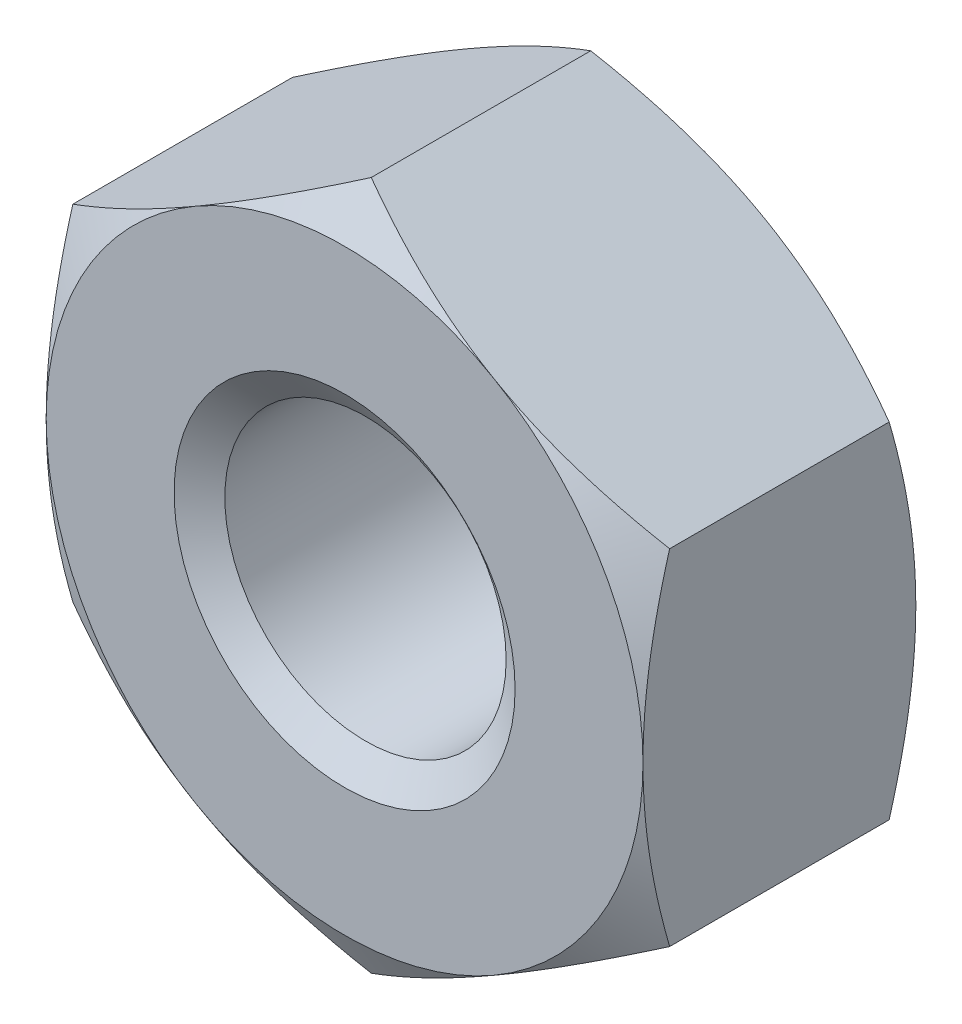
ISO-10303-21;
HEADER;
FILE_DESCRIPTION(('STEP AP214'),'2;1');
FILE_NAME('part.step','',(''),(''),'','','');
FILE_SCHEMA(('AUTOMOTIVE_DESIGN { 1 0 10303 214 1 1 1 1 }'));
ENDSEC;
DATA;
#1=APPLICATION_CONTEXT('core data for automotive mechanical design processes');
#2=APPLICATION_PROTOCOL_DEFINITION('international standard','automotive_design',2000,#1);
#3=PRODUCT_CONTEXT('',#1,'mechanical');
#4=PRODUCT('Part','Part','',(#3));
#5=PRODUCT_RELATED_PRODUCT_CATEGORY('part','',(#4));
#6=PRODUCT_DEFINITION_FORMATION('','',#4);
#7=PRODUCT_DEFINITION_CONTEXT('part definition',#1,'design');
#8=PRODUCT_DEFINITION('design','',#6,#7);
#9=PRODUCT_DEFINITION_SHAPE('','',#8);
#10=(LENGTH_UNIT() NAMED_UNIT(*) SI_UNIT(.MILLI.,.METRE.));
#11=(NAMED_UNIT(*) PLANE_ANGLE_UNIT() SI_UNIT($,.RADIAN.));
#12=(NAMED_UNIT(*) SI_UNIT($,.STERADIAN.) SOLID_ANGLE_UNIT());
#13=UNCERTAINTY_MEASURE_WITH_UNIT(LENGTH_MEASURE(1.E-05),#10,'distance_accuracy_value','');
#14=(GEOMETRIC_REPRESENTATION_CONTEXT(3) GLOBAL_UNCERTAINTY_ASSIGNED_CONTEXT((#13)) GLOBAL_UNIT_ASSIGNED_CONTEXT((#10,
#11,#12)) REPRESENTATION_CONTEXT('',''));
#15=CARTESIAN_POINT('',(0.,0.,0.));
#16=DIRECTION('',(0.,0.,1.));
#17=DIRECTION('',(1.,0.,0.));
#18=AXIS2_PLACEMENT_3D('',#15,#16,#17);
#19=CARTESIAN_POINT('',(0.,0.,-3.2));
#20=DIRECTION('',(0.,0.,1.));
#21=DIRECTION('',(1.,0.,0.));
#22=AXIS2_PLACEMENT_3D('',#19,#20,#21);
#23=CYLINDRICAL_SURFACE('',#22,1.65);
#24=CARTESIAN_POINT('',(0.,0.,-0.245072638373397));
#25=DIRECTION('',(0.,0.,1.));
#26=DIRECTION('',(1.,0.,0.));
#27=AXIS2_PLACEMENT_3D('',#24,#25,#26);
#28=CIRCLE('',#27,1.65);
#29=CARTESIAN_POINT('',(1.65,0.,-0.245072638373397));
#30=VERTEX_POINT('',#29);
#31=EDGE_CURVE('E174',#30,#30,#28,.F.);
#32=ORIENTED_EDGE('',*,*,#31,.F.);
#33=EDGE_LOOP('',(#32));
#34=FACE_BOUND('',#33,.T.);
#35=CARTESIAN_POINT('',(0.,0.,-2.9295273616266));
#36=DIRECTION('',(0.,0.,-1.));
#37=DIRECTION('',(-1.,0.,0.));
#38=AXIS2_PLACEMENT_3D('',#35,#36,#37);
#39=CIRCLE('',#38,1.65);
#40=CARTESIAN_POINT('',(-1.65,0.,-2.9295273616266));
#41=VERTEX_POINT('',#40);
#42=EDGE_CURVE('E39',#41,#41,#39,.F.);
#43=ORIENTED_EDGE('',*,*,#42,.F.);
#44=EDGE_LOOP('',(#43));
#45=FACE_BOUND('',#44,.T.);
#46=ADVANCED_FACE('F34',(#34,#45),#23,.F.);
#47=CARTESIAN_POINT('',(0.,4.04145188432739,-3.2));
#48=DIRECTION('',(0.,0.,-1.));
#49=DIRECTION('',(-1.,0.,0.));
#50=AXIS2_PLACEMENT_3D('',#47,#48,#49);
#51=PLANE('',#50);
#52=CARTESIAN_POINT('',(0.,0.,-3.2));
#53=DIRECTION('',(0.,0.,-1.));
#54=DIRECTION('',(-1.,0.,0.));
#55=AXIS2_PLACEMENT_3D('',#52,#53,#54);
#56=CIRCLE('',#55,3.5);
#57=CARTESIAN_POINT('',(-3.5,0.,-3.2));
#58=VERTEX_POINT('',#57);
#59=CARTESIAN_POINT('',(-1.75000000000002,-3.03108891324552,-3.2));
#60=VERTEX_POINT('',#59);
#61=EDGE_CURVE('E170',#58,#60,#56,.F.);
#62=ORIENTED_EDGE('',*,*,#61,.F.);
#63=CARTESIAN_POINT('',(-1.75000000000001,3.03108891324553,-3.2));
#64=VERTEX_POINT('',#63);
#65=EDGE_CURVE('E152',#64,#58,#56,.F.);
#66=ORIENTED_EDGE('',*,*,#65,.F.);
#67=CARTESIAN_POINT('',(1.75000000000002,3.03108891324552,-3.2));
#68=VERTEX_POINT('',#67);
#69=EDGE_CURVE('E169',#68,#64,#56,.F.);
#70=ORIENTED_EDGE('',*,*,#69,.F.);
#71=CARTESIAN_POINT('',(0.,0.,-3.2));
#72=DIRECTION('',(0.,0.,1.));
#73=DIRECTION('',(1.,0.,0.));
#74=AXIS2_PLACEMENT_3D('',#71,#72,#73);
#75=CIRCLE('',#74,3.5);
#76=CARTESIAN_POINT('',(3.5,0.,-3.2));
#77=VERTEX_POINT('',#76);
#78=EDGE_CURVE('E244',#77,#68,#75,.T.);
#79=ORIENTED_EDGE('',*,*,#78,.F.);
#80=CARTESIAN_POINT('',(1.75000000000001,-3.03108891324553,-3.2));
#81=VERTEX_POINT('',#80);
#82=EDGE_CURVE('E360',#81,#77,#56,.F.);
#83=ORIENTED_EDGE('',*,*,#82,.F.);
#84=EDGE_CURVE('E364',#60,#81,#56,.F.);
#85=ORIENTED_EDGE('',*,*,#84,.F.);
#86=EDGE_LOOP('',(#62,#66,#70,#79,#83,#85));
#87=FACE_BOUND('',#86,.T.);
#88=CARTESIAN_POINT('',(0.,0.,-3.2));
#89=DIRECTION('',(0.,0.,-1.));
#90=DIRECTION('',(-1.,0.,0.));
#91=AXIS2_PLACEMENT_3D('',#88,#89,#90);
#92=CIRCLE('',#91,2.);
#93=CARTESIAN_POINT('',(-2.,0.,-3.2));
#94=VERTEX_POINT('',#93);
#95=EDGE_CURVE('E177',#94,#94,#92,.F.);
#96=ORIENTED_EDGE('',*,*,#95,.T.);
#97=EDGE_LOOP('',(#96));
#98=FACE_BOUND('',#97,.T.);
#99=ADVANCED_FACE('F297',(#87,#98),#51,.T.);
#100=CARTESIAN_POINT('',(0.,4.04145188432739,0.));
#101=DIRECTION('',(0.,0.,-1.));
#102=DIRECTION('',(-1.,0.,0.));
#103=AXIS2_PLACEMENT_3D('',#100,#101,#102);
#104=PLANE('',#103);
#105=CARTESIAN_POINT('',(0.,0.,0.));
#106=DIRECTION('',(0.,0.,-1.));
#107=DIRECTION('',(-1.,0.,0.));
#108=AXIS2_PLACEMENT_3D('',#105,#106,#107);
#109=CIRCLE('',#108,3.5);
#110=CARTESIAN_POINT('',(-3.5,0.,0.));
#111=VERTEX_POINT('',#110);
#112=CARTESIAN_POINT('',(-1.75000000000001,3.03108891324553,0.));
#113=VERTEX_POINT('',#112);
#114=EDGE_CURVE('E11',#111,#113,#109,.T.);
#115=ORIENTED_EDGE('',*,*,#114,.F.);
#116=CARTESIAN_POINT('',(-1.75000000000002,-3.03108891324552,0.));
#117=VERTEX_POINT('',#116);
#118=EDGE_CURVE('E46',#117,#111,#109,.T.);
#119=ORIENTED_EDGE('',*,*,#118,.F.);
#120=CARTESIAN_POINT('',(1.75000000000001,-3.03108891324553,0.));
#121=VERTEX_POINT('',#120);
#122=EDGE_CURVE('E173',#121,#117,#109,.T.);
#123=ORIENTED_EDGE('',*,*,#122,.F.);
#124=CARTESIAN_POINT('',(3.5,0.,0.));
#125=VERTEX_POINT('',#124);
#126=EDGE_CURVE('E351',#125,#121,#109,.T.);
#127=ORIENTED_EDGE('',*,*,#126,.F.);
#128=CARTESIAN_POINT('',(0.,0.,0.));
#129=DIRECTION('',(0.,0.,1.));
#130=DIRECTION('',(1.,0.,0.));
#131=AXIS2_PLACEMENT_3D('',#128,#129,#130);
#132=CIRCLE('',#131,3.5);
#133=CARTESIAN_POINT('',(1.75000000000002,3.03108891324552,0.));
#134=VERTEX_POINT('',#133);
#135=EDGE_CURVE('E128',#125,#134,#132,.T.);
#136=ORIENTED_EDGE('',*,*,#135,.T.);
#137=EDGE_CURVE('E44',#113,#134,#109,.T.);
#138=ORIENTED_EDGE('',*,*,#137,.F.);
#139=EDGE_LOOP('',(#115,#119,#123,#127,#136,#138));
#140=FACE_BOUND('',#139,.T.);
#141=CARTESIAN_POINT('',(0.,0.,0.));
#142=DIRECTION('',(0.,0.,1.));
#143=DIRECTION('',(1.,0.,0.));
#144=AXIS2_PLACEMENT_3D('',#141,#142,#143);
#145=CIRCLE('',#144,2.);
#146=CARTESIAN_POINT('',(2.,0.,0.));
#147=VERTEX_POINT('',#146);
#148=EDGE_CURVE('E176',#147,#147,#145,.T.);
#149=ORIENTED_EDGE('',*,*,#148,.F.);
#150=EDGE_LOOP('',(#149));
#151=FACE_BOUND('',#150,.T.);
#152=ADVANCED_FACE('F249',(#140,#151),#104,.F.);
#153=CARTESIAN_POINT('',(0.,4.04145188432739,-3.2));
#154=DIRECTION('',(-0.500000000000003,0.866025403784437,0.));
#155=DIRECTION('',(-0.866025403784437,-0.500000000000003,0.));
#156=AXIS2_PLACEMENT_3D('',#153,#154,#155);
#157=PLANE('',#156);
#158=DIRECTION('',(0.,0.,1.));
#159=VECTOR('',#158,1.);
#160=CARTESIAN_POINT('',(-3.5,2.02072594216368,-3.2));
#161=LINE('',#160,#159);
#162=CARTESIAN_POINT('',(-3.5,2.02072594216372,-2.88739260883035));
#163=VERTEX_POINT('',#162);
#164=CARTESIAN_POINT('',(-3.5,2.02072594216368,-0.312607391169644));
#165=VERTEX_POINT('',#164);
#166=EDGE_CURVE('E164',#163,#165,#161,.T.);
#167=ORIENTED_EDGE('',*,*,#166,.T.);
#168=CARTESIAN_POINT('',(-3.5002,2.02061047210984,-0.312674060693372));
#169=CARTESIAN_POINT('',(-3.34639282154755,2.10941108799266,-0.261385788989984));
#170=CARTESIAN_POINT('',(-3.19125798916558,2.19897822522908,-0.214740953816197));
#171=CARTESIAN_POINT('',(-2.87830199342322,2.37966345361544,-0.133321875533348));
#172=CARTESIAN_POINT('',(-2.7204752692125,2.47078475532382,-0.0985764355845608));
#173=CARTESIAN_POINT('',(-2.40677778961987,2.65189807961073,-0.0444900271828351));
#174=CARTESIAN_POINT('',(-2.25095530083931,2.74186223545399,-0.0247890862603804));
#175=CARTESIAN_POINT('',(-1.93857711279463,2.92221386641055,-0.00127013273725341));
#176=CARTESIAN_POINT('',(-1.78202254896577,3.01260068598001,0.00256735545443538));
#177=CARTESIAN_POINT('',(-1.48949078007901,3.1814939814933,-0.00541530187697795));
#178=CARTESIAN_POINT('',(-1.35346978754209,3.26002573814993,-0.015275434069608));
#179=CARTESIAN_POINT('',(-1.082313979711,3.41657761679354,-0.046526466899406));
#180=CARTESIAN_POINT('',(-0.947180102315315,3.49459719728458,-0.0679280432858015));
#181=CARTESIAN_POINT('',(-0.675465207594812,3.65147186489429,-0.121430407880582));
#182=CARTESIAN_POINT('',(-0.538918580721659,3.73030709667644,-0.153757994445093));
#183=CARTESIAN_POINT('',(-0.267861907055491,3.88680174018325,-0.227128933808003));
#184=CARTESIAN_POINT('',(-0.133348387531455,3.9644631568901,-0.268155046569877));
#185=CARTESIAN_POINT('',(0.000200000000008864,4.04156735438123,-0.312674060693383));
#186=B_SPLINE_CURVE_WITH_KNOTS('',3,(#168,#169,#170,#171,#172,#173,#174,#175,#176,#177,#178,
#179,#180,#181,#182,#183,#184,#185),.UNSPECIFIED.,.F.,.F.,(4,2,2,2,2,2,2,2,4),(0.,
0.554793832886255,1.11092123814984,1.65328467083219,2.19498204478403,2.66665130850861,
3.13875761298268,3.62133612600511,4.10296698719189),.UNSPECIFIED.);
#187=EDGE_CURVE('E133',#165,#113,#186,.T.);
#188=ORIENTED_EDGE('',*,*,#187,.T.);
#189=CARTESIAN_POINT('',(0.,4.04145188432739,-0.312607391169655));
#190=VERTEX_POINT('',#189);
#191=EDGE_CURVE('E53',#113,#190,#186,.T.);
#192=ORIENTED_EDGE('',*,*,#191,.T.);
#193=DIRECTION('',(0.,0.,1.));
#194=VECTOR('',#193,1.);
#195=CARTESIAN_POINT('',(0.,4.04145188432739,-3.2));
#196=LINE('',#195,#194);
#197=CARTESIAN_POINT('',(0.,4.04145188432739,-2.88739260883035));
#198=VERTEX_POINT('',#197);
#199=EDGE_CURVE('E149',#198,#190,#196,.T.);
#200=ORIENTED_EDGE('',*,*,#199,.F.);
#201=CARTESIAN_POINT('',(-3.5002,2.02061047210984,-2.88732593930663));
#202=CARTESIAN_POINT('',(-3.34639282154755,2.10941108799266,-2.93861421101002));
#203=CARTESIAN_POINT('',(-3.19125798916558,2.19897822522908,-2.9852590461838));
#204=CARTESIAN_POINT('',(-2.87830199342322,2.37966345361544,-3.06667812446665));
#205=CARTESIAN_POINT('',(-2.7204752692125,2.47078475532382,-3.10142356441544));
#206=CARTESIAN_POINT('',(-2.40677778961987,2.65189807961073,-3.15550997281717));
#207=CARTESIAN_POINT('',(-2.25095530083931,2.74186223545399,-3.17521091373962));
#208=CARTESIAN_POINT('',(-1.93857711279463,2.92221386641055,-3.19872986726275));
#209=CARTESIAN_POINT('',(-1.78202254896577,3.01260068598001,-3.20256735545444));
#210=CARTESIAN_POINT('',(-1.48949078007901,3.1814939814933,-3.19458469812302));
#211=CARTESIAN_POINT('',(-1.35346978754209,3.26002573814993,-3.18472456593039));
#212=CARTESIAN_POINT('',(-1.082313979711,3.41657761679354,-3.1534735331006));
#213=CARTESIAN_POINT('',(-0.947180102315315,3.49459719728458,-3.1320719567142));
#214=CARTESIAN_POINT('',(-0.675465207594812,3.65147186489429,-3.07856959211942));
#215=CARTESIAN_POINT('',(-0.538918580721659,3.73030709667644,-3.04624200555491));
#216=CARTESIAN_POINT('',(-0.267861907055491,3.88680174018325,-2.972871066192));
#217=CARTESIAN_POINT('',(-0.133348387531456,3.9644631568901,-2.93184495343012));
#218=CARTESIAN_POINT('',(0.00020000000000887,4.04156735438123,-2.88732593930662));
#219=B_SPLINE_CURVE_WITH_KNOTS('',3,(#201,#202,#203,#204,#205,#206,#207,#208,#209,#210,#211,
#212,#213,#214,#215,#216,#217,#218),.UNSPECIFIED.,.F.,.F.,(4,2,2,2,2,2,2,2,4),(0.,
0.554793832886255,1.11092123814984,1.65328467083219,2.19498204478403,2.66665130850861,
3.13875761298268,3.62133612600511,4.10296698719189),.UNSPECIFIED.);
#220=EDGE_CURVE('E167',#64,#198,#219,.T.);
#221=ORIENTED_EDGE('',*,*,#220,.F.);
#222=EDGE_CURVE('E259',#163,#64,#219,.T.);
#223=ORIENTED_EDGE('',*,*,#222,.F.);
#224=EDGE_LOOP('',(#167,#188,#192,#200,#221,#223));
#225=FACE_BOUND('',#224,.T.);
#226=ADVANCED_FACE('F36',(#225),#157,.T.);
#227=CARTESIAN_POINT('',(3.5,2.02072594216367,-3.2));
#228=DIRECTION('',(0.500000000000007,0.866025403784435,0.));
#229=DIRECTION('',(-0.866025403784435,0.500000000000007,0.));
#230=AXIS2_PLACEMENT_3D('',#227,#228,#229);
#231=PLANE('',#230);
#232=ORIENTED_EDGE('',*,*,#199,.T.);
#233=CARTESIAN_POINT('',(-0.000199999999990868,4.04156735438123,-0.312674060693383));
#234=CARTESIAN_POINT('',(0.153607178452458,3.95276673849841,-0.261385788989994));
#235=CARTESIAN_POINT('',(0.308742010834433,3.86319960126199,-0.214740953816206));
#236=CARTESIAN_POINT('',(0.62169800657679,3.68251437287563,-0.133321875533356));
#237=CARTESIAN_POINT('',(0.779524730787505,3.59139307116725,-0.0985764355845671));
#238=CARTESIAN_POINT('',(1.09322221038014,3.41027974688034,-0.0444900271828396));
#239=CARTESIAN_POINT('',(1.2490446991607,3.32031559103708,-0.024789086260384));
#240=CARTESIAN_POINT('',(1.56142288720538,3.13996396008051,-0.00127013273725514));
#241=CARTESIAN_POINT('',(1.71797745103424,3.04957714051106,0.00256735545443454));
#242=CARTESIAN_POINT('',(2.010509219921,2.88068384499777,-0.00541530187697728));
#243=CARTESIAN_POINT('',(2.14653021245791,2.80215208834114,-0.0152754340696065));
#244=CARTESIAN_POINT('',(2.417686020289,2.64560020969752,-0.0465264668994026));
#245=CARTESIAN_POINT('',(2.55281989768469,2.56758062920648,-0.0679280432857971));
#246=CARTESIAN_POINT('',(2.82453479240519,2.41070596159677,-0.121430407880576));
#247=CARTESIAN_POINT('',(2.96108141927834,2.33187072981462,-0.153757994445086));
#248=CARTESIAN_POINT('',(3.23213809294451,2.17537608630781,-0.227128933807994));
#249=CARTESIAN_POINT('',(3.36665161246854,2.09771466960097,-0.268155046569867));
#250=CARTESIAN_POINT('',(3.5002,2.02061047210983,-0.312674060693371));
#251=B_SPLINE_CURVE_WITH_KNOTS('',3,(#233,#234,#235,#236,#237,#238,#239,#240,#241,#242,#243,
#244,#245,#246,#247,#248,#249,#250),.UNSPECIFIED.,.F.,.F.,(4,2,2,2,2,2,2,2,4),(0.,
0.554793832886257,1.11092123814984,1.6532846708322,2.19498204478404,2.66665130850861,
3.13875761298268,3.62133612600511,4.10296698719188),.UNSPECIFIED.);
#252=EDGE_CURVE('E143',#190,#134,#251,.T.);
#253=ORIENTED_EDGE('',*,*,#252,.T.);
#254=CARTESIAN_POINT('',(3.5,2.02072594216371,-0.312607391169655));
#255=VERTEX_POINT('',#254);
#256=EDGE_CURVE('E60',#134,#255,#251,.T.);
#257=ORIENTED_EDGE('',*,*,#256,.T.);
#258=DIRECTION('',(0.,0.,1.));
#259=VECTOR('',#258,1.);
#260=CARTESIAN_POINT('',(3.5,2.02072594216367,-3.2));
#261=LINE('',#260,#259);
#262=CARTESIAN_POINT('',(3.5,2.02072594216371,-2.88739260883035));
#263=VERTEX_POINT('',#262);
#264=EDGE_CURVE('E142',#263,#255,#261,.T.);
#265=ORIENTED_EDGE('',*,*,#264,.F.);
#266=CARTESIAN_POINT('',(-0.000199999999990853,4.04156735438123,-2.88732593930662));
#267=CARTESIAN_POINT('',(0.153607178452459,3.95276673849841,-2.93861421101001));
#268=CARTESIAN_POINT('',(0.308742010834433,3.86319960126199,-2.9852590461838));
#269=CARTESIAN_POINT('',(0.62169800657679,3.68251437287563,-3.06667812446665));
#270=CARTESIAN_POINT('',(0.779524730787505,3.59139307116725,-3.10142356441543));
#271=CARTESIAN_POINT('',(1.09322221038014,3.41027974688034,-3.15550997281716));
#272=CARTESIAN_POINT('',(1.2490446991607,3.32031559103708,-3.17521091373962));
#273=CARTESIAN_POINT('',(1.56142288720538,3.13996396008051,-3.19872986726275));
#274=CARTESIAN_POINT('',(1.71797745103424,3.04957714051106,-3.20256735545444));
#275=CARTESIAN_POINT('',(2.010509219921,2.88068384499777,-3.19458469812302));
#276=CARTESIAN_POINT('',(2.14653021245791,2.80215208834114,-3.1847245659304));
#277=CARTESIAN_POINT('',(2.417686020289,2.64560020969752,-3.1534735331006));
#278=CARTESIAN_POINT('',(2.55281989768469,2.56758062920648,-3.1320719567142));
#279=CARTESIAN_POINT('',(2.82453479240519,2.41070596159677,-3.07856959211943));
#280=CARTESIAN_POINT('',(2.96108141927834,2.33187072981462,-3.04624200555492));
#281=CARTESIAN_POINT('',(3.23213809294451,2.17537608630781,-2.97287106619201));
#282=CARTESIAN_POINT('',(3.36665161246854,2.09771466960097,-2.93184495343014));
#283=CARTESIAN_POINT('',(3.5002,2.02061047210983,-2.88732593930663));
#284=B_SPLINE_CURVE_WITH_KNOTS('',3,(#266,#267,#268,#269,#270,#271,#272,#273,#274,#275,#276,
#277,#278,#279,#280,#281,#282,#283),.UNSPECIFIED.,.F.,.F.,(4,2,2,2,2,2,2,2,4),(0.,
0.554793832886257,1.11092123814984,1.6532846708322,2.19498204478404,2.66665130850861,
3.13875761298268,3.62133612600511,4.10296698719188),.UNSPECIFIED.);
#285=EDGE_CURVE('E253',#68,#263,#284,.T.);
#286=ORIENTED_EDGE('',*,*,#285,.F.);
#287=EDGE_CURVE('E258',#198,#68,#284,.T.);
#288=ORIENTED_EDGE('',*,*,#287,.F.);
#289=EDGE_LOOP('',(#232,#253,#257,#265,#286,#288));
#290=FACE_BOUND('',#289,.T.);
#291=ADVANCED_FACE('F140',(#290),#231,.T.);
#292=CARTESIAN_POINT('',(3.5,2.02072594216367,-3.2));
#293=DIRECTION('',(-1.,0.,0.));
#294=DIRECTION('',(0.,0.,1.));
#295=AXIS2_PLACEMENT_3D('',#292,#293,#294);
#296=PLANE('',#295);
#297=CARTESIAN_POINT('',(3.5,-5.35926299121409,-1.6748434685856));
#298=CARTESIAN_POINT('',(3.5,-5.20559319908845,-1.60058173692107));
#299=CARTESIAN_POINT('',(3.5,-5.05156008083379,-1.52705822833151));
#300=CARTESIAN_POINT('',(3.5,-4.74257074180714,-1.38190950344755));
#301=CARTESIAN_POINT('',(3.5,-4.5876143668244,-1.31028461582136));
#302=CARTESIAN_POINT('',(3.5,-4.27574500225546,-1.16897765517627));
#303=CARTESIAN_POINT('',(3.5,-4.11882589028195,-1.09930904568019));
#304=CARTESIAN_POINT('',(3.5,-3.80369792903859,-0.962964262242787));
#305=CARTESIAN_POINT('',(3.5,-3.64548914750599,-0.896287932319544));
#306=CARTESIAN_POINT('',(3.5,-3.32556618401859,-0.765931819095091));
#307=CARTESIAN_POINT('',(3.5,-3.16383281219927,-0.702298873688887));
#308=CARTESIAN_POINT('',(3.5,-2.83845840945601,-0.580016702089512));
#309=CARTESIAN_POINT('',(3.5,-2.67481716858829,-0.52136803037071));
#310=CARTESIAN_POINT('',(3.5,-2.34570278472052,-0.410630279877038));
#311=CARTESIAN_POINT('',(3.5,-2.18023438248745,-0.358527255435872));
#312=CARTESIAN_POINT('',(3.5,-1.84694522806373,-0.262572936976455));
#313=CARTESIAN_POINT('',(3.5,-1.67912523787533,-0.218719033467169));
#314=CARTESIAN_POINT('',(3.5,-1.34101828610928,-0.141391945584796));
#315=CARTESIAN_POINT('',(3.5,-1.17073068027696,-0.107921525211981));
#316=CARTESIAN_POINT('',(3.5,-0.828102385138509,-0.0536149564320564));
#317=CARTESIAN_POINT('',(3.5,-0.655761694017326,-0.0327788191952413));
#318=CARTESIAN_POINT('',(3.5,-0.311020490924472,-0.00558408650575975));
#319=CARTESIAN_POINT('',(3.5,-0.138627397207281,0.000866163165908758));
#320=CARTESIAN_POINT('',(3.5,0.206038074906516,-0.0010535580779476));
#321=CARTESIAN_POINT('',(3.5,0.378310473023161,-0.00941968196343297));
#322=CARTESIAN_POINT('',(3.5,0.672490555822308,-0.0357688927868924));
#323=CARTESIAN_POINT('',(3.5,0.79472279108407,-0.0503206340384212));
#324=CARTESIAN_POINT('',(3.5,1.03824305430558,-0.0859367340533544));
#325=CARTESIAN_POINT('',(3.5,1.15953093025884,-0.107002119926139));
#326=CARTESIAN_POINT('',(3.5,1.52187914771345,-0.178863187081449));
#327=CARTESIAN_POINT('',(3.5,1.76124104212628,-0.238305275622005));
#328=CARTESIAN_POINT('',(3.5,2.11940971387704,-0.340826814402547));
#329=CARTESIAN_POINT('',(3.5,2.24008344316342,-0.377749699085175));
#330=CARTESIAN_POINT('',(3.5,2.48017139213724,-0.455249007699284));
#331=CARTESIAN_POINT('',(3.5,2.59958641795608,-0.495822911663539));
#332=CARTESIAN_POINT('',(3.5,2.83665760451793,-0.57977998678274));
#333=CARTESIAN_POINT('',(3.5,2.95431988203478,-0.623146060034302));
#334=CARTESIAN_POINT('',(3.5,3.18873153508794,-0.712423559566852));
#335=CARTESIAN_POINT('',(3.5,3.30548051959458,-0.758336014592935));
#336=CARTESIAN_POINT('',(3.5,3.42180736613342,-0.805270380724054));
#337=B_SPLINE_CURVE_WITH_KNOTS('',3,(#297,#298,#299,#300,#301,#302,#303,#304,#305,#306,#307,
#308,#309,#310,#311,#312,#313,#314,#315,#316,#317,#318,#319,#320,#321,#322,#323,#324,#325,#326,
#327,#328,#329,#330,#331,#332,#333,#334,#335,#336),.UNSPECIFIED.,.F.,.F.,(4,2,2,2,2,2,2,2,2,2,2,
2,2,2,2,2,2,2,2,4),(0.,0.512025318465739,1.02413870177436,1.53918270315242,2.05419982499224,
2.57553975872799,3.09693761309354,3.61720506610402,4.13730766217539,4.65754858684366,
5.17778997146964,5.69470725122285,6.21149033452403,6.58059623222333,6.94976036239486,
7.68863804939852,8.06719621660478,8.4454950747676,8.82166461280098,9.19798724733408),.UNSPECIFIED.);
#338=CARTESIAN_POINT('',(3.49999999999999,-2.02072594216373,-0.312607391169655));
#339=VERTEX_POINT('',#338);
#340=EDGE_CURVE('E135',#339,#125,#337,.T.);
#341=ORIENTED_EDGE('',*,*,#340,.F.);
#342=DIRECTION('',(0.,0.,1.));
#343=VECTOR('',#342,1.);
#344=CARTESIAN_POINT('',(3.5,-2.02072594216372,-3.2));
#345=LINE('',#344,#343);
#346=CARTESIAN_POINT('',(3.49999999999999,-2.02072594216373,-2.88739260883035));
#347=VERTEX_POINT('',#346);
#348=EDGE_CURVE('E150',#347,#339,#345,.T.);
#349=ORIENTED_EDGE('',*,*,#348,.F.);
#350=CARTESIAN_POINT('',(3.5,-5.35926299121409,-1.5251565314144));
#351=CARTESIAN_POINT('',(3.5,-5.20559319908845,-1.59941826307893));
#352=CARTESIAN_POINT('',(3.5,-5.05156008083379,-1.67294177166849));
#353=CARTESIAN_POINT('',(3.5,-4.74257074180714,-1.81809049655245));
#354=CARTESIAN_POINT('',(3.5,-4.5876143668244,-1.88971538417864));
#355=CARTESIAN_POINT('',(3.5,-4.27574500225546,-2.03102234482373));
#356=CARTESIAN_POINT('',(3.5,-4.11882589028195,-2.10069095431981));
#357=CARTESIAN_POINT('',(3.5,-3.80369792903859,-2.23703573775721));
#358=CARTESIAN_POINT('',(3.5,-3.64548914750599,-2.30371206768046));
#359=CARTESIAN_POINT('',(3.5,-3.32556618401859,-2.43406818090491));
#360=CARTESIAN_POINT('',(3.5,-3.16383281219927,-2.49770112631111));
#361=CARTESIAN_POINT('',(3.5,-2.838458409456,-2.61998329791049));
#362=CARTESIAN_POINT('',(3.5,-2.67481716858829,-2.67863196962929));
#363=CARTESIAN_POINT('',(3.5,-2.34570278472052,-2.78936972012296));
#364=CARTESIAN_POINT('',(3.5,-2.18023438248745,-2.84147274456413));
#365=CARTESIAN_POINT('',(3.5,-1.84694522806373,-2.93742706302355));
#366=CARTESIAN_POINT('',(3.5,-1.67912523787533,-2.98128096653283));
#367=CARTESIAN_POINT('',(3.5,-1.34101828610928,-3.05860805441521));
#368=CARTESIAN_POINT('',(3.5,-1.17073068027696,-3.09207847478802));
#369=CARTESIAN_POINT('',(3.5,-0.828102385138509,-3.14638504356795));
#370=CARTESIAN_POINT('',(3.5,-0.655761694017326,-3.16722118080476));
#371=CARTESIAN_POINT('',(3.5,-0.311020490924472,-3.19441591349424));
#372=CARTESIAN_POINT('',(3.5,-0.138627397207281,-3.20086616316591));
#373=CARTESIAN_POINT('',(3.5,0.206038074906516,-3.19894644192205));
#374=CARTESIAN_POINT('',(3.5,0.378310473023161,-3.19058031803657));
#375=CARTESIAN_POINT('',(3.5,0.672490555822308,-3.16423110721311));
#376=CARTESIAN_POINT('',(3.5,0.794722791084071,-3.14967936596158));
#377=CARTESIAN_POINT('',(3.5,1.03824305430558,-3.11406326594665));
#378=CARTESIAN_POINT('',(3.5,1.15953093025884,-3.09299788007386));
#379=CARTESIAN_POINT('',(3.5,1.52187914771345,-3.02113681291855));
#380=CARTESIAN_POINT('',(3.5,1.76124104212628,-2.961694724378));
#381=CARTESIAN_POINT('',(3.5,2.11940971387704,-2.85917318559745));
#382=CARTESIAN_POINT('',(3.5,2.24008344316342,-2.82225030091483));
#383=CARTESIAN_POINT('',(3.5,2.48017139213724,-2.74475099230072));
#384=CARTESIAN_POINT('',(3.5,2.59958641795608,-2.70417708833646));
#385=CARTESIAN_POINT('',(3.5,2.83665760451793,-2.62022001321726));
#386=CARTESIAN_POINT('',(3.5,2.95431988203478,-2.5768539399657));
#387=CARTESIAN_POINT('',(3.5,3.18873153508794,-2.48757644043315));
#388=CARTESIAN_POINT('',(3.5,3.30548051959458,-2.44166398540707));
#389=CARTESIAN_POINT('',(3.5,3.42180736613342,-2.39472961927595));
#390=B_SPLINE_CURVE_WITH_KNOTS('',3,(#350,#351,#352,#353,#354,#355,#356,#357,#358,#359,#360,
#361,#362,#363,#364,#365,#366,#367,#368,#369,#370,#371,#372,#373,#374,#375,#376,#377,#378,#379,
#380,#381,#382,#383,#384,#385,#386,#387,#388,#389),.UNSPECIFIED.,.F.,.F.,(4,2,2,2,2,2,2,2,2,2,2,
2,2,2,2,2,2,2,2,4),(0.,0.512025318465739,1.02413870177436,1.53918270315242,2.05419982499224,
2.57553975872799,3.09693761309354,3.61720506610402,4.13730766217539,4.65754858684366,
5.17778997146963,5.69470725122285,6.21149033452403,6.58059623222333,6.94976036239486,
7.68863804939852,8.06719621660478,8.4454950747676,8.82166461280097,9.19798724733408),.UNSPECIFIED.);
#391=EDGE_CURVE('E265',#347,#77,#390,.T.);
#392=ORIENTED_EDGE('',*,*,#391,.T.);
#393=EDGE_CURVE('E148',#77,#263,#390,.T.);
#394=ORIENTED_EDGE('',*,*,#393,.T.);
#395=ORIENTED_EDGE('',*,*,#264,.T.);
#396=EDGE_CURVE('E125',#125,#255,#337,.T.);
#397=ORIENTED_EDGE('',*,*,#396,.F.);
#398=EDGE_LOOP('',(#341,#349,#392,#394,#395,#397));
#399=FACE_BOUND('',#398,.T.);
#400=ADVANCED_FACE('F146',(#399),#296,.F.);
#401=CARTESIAN_POINT('',(0.,-4.04145188432744,-3.2));
#402=DIRECTION('',(0.500000000000004,-0.866025403784436,0.));
#403=DIRECTION('',(0.866025403784436,0.500000000000004,0.));
#404=AXIS2_PLACEMENT_3D('',#401,#402,#403);
#405=PLANE('',#404);
#406=ORIENTED_EDGE('',*,*,#348,.T.);
#407=CARTESIAN_POINT('',(3.5002,-2.02061047210988,-0.312674060693386));
#408=CARTESIAN_POINT('',(3.34639282154755,-2.1094110879927,-0.261385788989998));
#409=CARTESIAN_POINT('',(3.19125798916558,-2.19897822522913,-0.214740953816212));
#410=CARTESIAN_POINT('',(2.87830199342322,-2.37966345361549,-0.133321875533364));
#411=CARTESIAN_POINT('',(2.7204752692125,-2.47078475532386,-0.0985764355845775));
#412=CARTESIAN_POINT('',(2.40677778961987,-2.65189807961078,-0.0444900271828536));
#413=CARTESIAN_POINT('',(2.25095530083931,-2.74186223545403,-0.0247890862603999));
#414=CARTESIAN_POINT('',(1.93857711279462,-2.9222138664106,-0.00127013273727477));
#415=CARTESIAN_POINT('',(1.78202254896576,-3.01260068598006,0.00256735545441309));
#416=CARTESIAN_POINT('',(1.489490780079,-3.18149398149335,-0.00541530187700204));
#417=CARTESIAN_POINT('',(1.35346978754209,-3.26002573814998,-0.0152754340696328));
#418=CARTESIAN_POINT('',(1.082313979711,-3.41657761679359,-0.0465264668994314));
#419=CARTESIAN_POINT('',(0.947180102315313,-3.49459719728463,-0.0679280432858271));
#420=CARTESIAN_POINT('',(0.675465207594813,-3.65147186489434,-0.121430407880608));
#421=CARTESIAN_POINT('',(0.538918580721662,-3.73030709667649,-0.153757994445119));
#422=CARTESIAN_POINT('',(0.267861907055496,-3.8868017401833,-0.227128933808028));
#423=CARTESIAN_POINT('',(0.133348387531462,-3.96446315689014,-0.268155046569902));
#424=CARTESIAN_POINT('',(-0.000200000000001385,-4.04156735438127,-0.312674060693407));
#425=B_SPLINE_CURVE_WITH_KNOTS('',3,(#407,#408,#409,#410,#411,#412,#413,#414,#415,#416,#417,
#418,#419,#420,#421,#422,#423,#424),.UNSPECIFIED.,.F.,.F.,(4,2,2,2,2,2,2,2,4),(0.,
0.554793832886257,1.11092123814984,1.6532846708322,2.19498204478405,2.66665130850861,
3.13875761298269,3.62133612600511,4.10296698719189),.UNSPECIFIED.);
#426=EDGE_CURVE('E346',#339,#121,#425,.T.);
#427=ORIENTED_EDGE('',*,*,#426,.T.);
#428=CARTESIAN_POINT('',(0.,-4.04145188432739,-0.312607391169655));
#429=VERTEX_POINT('',#428);
#430=EDGE_CURVE('E225',#121,#429,#425,.T.);
#431=ORIENTED_EDGE('',*,*,#430,.T.);
#432=DIRECTION('',(0.,0.,1.));
#433=VECTOR('',#432,1.);
#434=CARTESIAN_POINT('',(0.,-4.04145188432744,-3.2));
#435=LINE('',#434,#433);
#436=CARTESIAN_POINT('',(0.,-4.04145188432739,-2.88739260883035));
#437=VERTEX_POINT('',#436);
#438=EDGE_CURVE('E155',#437,#429,#435,.T.);
#439=ORIENTED_EDGE('',*,*,#438,.F.);
#440=CARTESIAN_POINT('',(3.5002,-2.02061047210988,-2.88732593930662));
#441=CARTESIAN_POINT('',(3.34639282154755,-2.1094110879927,-2.93861421101));
#442=CARTESIAN_POINT('',(3.19125798916558,-2.19897822522913,-2.98525904618379));
#443=CARTESIAN_POINT('',(2.87830199342322,-2.37966345361549,-3.06667812446664));
#444=CARTESIAN_POINT('',(2.7204752692125,-2.47078475532386,-3.10142356441542));
#445=CARTESIAN_POINT('',(2.40677778961987,-2.65189807961078,-3.15550997281715));
#446=CARTESIAN_POINT('',(2.25095530083931,-2.74186223545403,-3.1752109137396));
#447=CARTESIAN_POINT('',(1.93857711279462,-2.9222138664106,-3.19872986726273));
#448=CARTESIAN_POINT('',(1.78202254896576,-3.01260068598006,-3.20256735545441));
#449=CARTESIAN_POINT('',(1.489490780079,-3.18149398149335,-3.194584698123));
#450=CARTESIAN_POINT('',(1.35346978754209,-3.26002573814998,-3.18472456593037));
#451=CARTESIAN_POINT('',(1.082313979711,-3.41657761679359,-3.15347353310057));
#452=CARTESIAN_POINT('',(0.947180102315312,-3.49459719728463,-3.13207195671417));
#453=CARTESIAN_POINT('',(0.675465207594813,-3.65147186489434,-3.07856959211939));
#454=CARTESIAN_POINT('',(0.538918580721661,-3.73030709667649,-3.04624200555488));
#455=CARTESIAN_POINT('',(0.267861907055496,-3.8868017401833,-2.97287106619197));
#456=CARTESIAN_POINT('',(0.133348387531462,-3.96446315689014,-2.9318449534301));
#457=CARTESIAN_POINT('',(-0.000200000000001391,-4.04156735438127,-2.88732593930659));
#458=B_SPLINE_CURVE_WITH_KNOTS('',3,(#440,#441,#442,#443,#444,#445,#446,#447,#448,#449,#450,
#451,#452,#453,#454,#455,#456,#457),.UNSPECIFIED.,.F.,.F.,(4,2,2,2,2,2,2,2,4),(0.,
0.554793832886258,1.11092123814984,1.6532846708322,2.19498204478405,2.66665130850862,
3.13875761298269,3.62133612600511,4.10296698719189),.UNSPECIFIED.);
#459=EDGE_CURVE('E271',#81,#437,#458,.T.);
#460=ORIENTED_EDGE('',*,*,#459,.F.);
#461=EDGE_CURVE('E270',#347,#81,#458,.T.);
#462=ORIENTED_EDGE('',*,*,#461,.F.);
#463=EDGE_LOOP('',(#406,#427,#431,#439,#460,#462));
#464=FACE_BOUND('',#463,.T.);
#465=ADVANCED_FACE('F281',(#464),#405,.T.);
#466=CARTESIAN_POINT('',(-3.5,-2.02072594216371,-3.2));
#467=DIRECTION('',(-0.500000000000006,-0.866025403784435,0.));
#468=DIRECTION('',(0.866025403784435,-0.500000000000006,0.));
#469=AXIS2_PLACEMENT_3D('',#466,#467,#468);
#470=PLANE('',#469);
#471=ORIENTED_EDGE('',*,*,#438,.T.);
#472=CARTESIAN_POINT('',(0.00019999999999873,-4.04156735438127,-0.312674060693407));
#473=CARTESIAN_POINT('',(-0.153607178452452,-3.95276673849845,-0.261385788990017));
#474=CARTESIAN_POINT('',(-0.308742010834428,-3.86319960126203,-0.214740953816229));
#475=CARTESIAN_POINT('',(-0.621698006576789,-3.68251437287567,-0.133321875533377));
#476=CARTESIAN_POINT('',(-0.779524730787505,-3.59139307116729,-0.0985764355845881));
#477=CARTESIAN_POINT('',(-1.09322221038014,-3.41027974688037,-0.0444900271828597));
#478=CARTESIAN_POINT('',(-1.24904469916071,-3.32031559103712,-0.0247890862604036));
#479=CARTESIAN_POINT('',(-1.56142288720539,-3.13996396008055,-0.00127013273727429));
#480=CARTESIAN_POINT('',(-1.71797745103425,-3.04957714051109,0.00256735545441543));
#481=CARTESIAN_POINT('',(-2.01050921992101,-2.8806838449978,-0.00541530187699616));
#482=CARTESIAN_POINT('',(-2.14653021245792,-2.80215208834117,-0.015275434069625));
#483=CARTESIAN_POINT('',(-2.41768602028901,-2.64560020969756,-0.0465264668994201));
#484=CARTESIAN_POINT('',(-2.55281989768469,-2.56758062920652,-0.067928043285814));
#485=CARTESIAN_POINT('',(-2.82453479240519,-2.41070596159681,-0.121430407880591));
#486=CARTESIAN_POINT('',(-2.96108141927834,-2.33187072981466,-0.1537579944451));
#487=CARTESIAN_POINT('',(-3.2321380929445,-2.17537608630785,-0.227128933808006));
#488=CARTESIAN_POINT('',(-3.36665161246854,-2.09771466960101,-0.268155046569878));
#489=CARTESIAN_POINT('',(-3.5002,-2.02061047210987,-0.312674060693381));
#490=B_SPLINE_CURVE_WITH_KNOTS('',3,(#472,#473,#474,#475,#476,#477,#478,#479,#480,#481,#482,
#483,#484,#485,#486,#487,#488,#489),.UNSPECIFIED.,.F.,.F.,(4,2,2,2,2,2,2,2,4),(0.,
0.554793832886263,1.11092123814985,1.65328467083221,2.19498204478406,2.66665130850863,
3.1387576129827,3.62133612600512,4.10296698719189),.UNSPECIFIED.);
#491=EDGE_CURVE('E344',#429,#117,#490,.T.);
#492=ORIENTED_EDGE('',*,*,#491,.T.);
#493=CARTESIAN_POINT('',(-3.5,-2.02072594216372,-0.312607391169655));
#494=VERTEX_POINT('',#493);
#495=EDGE_CURVE('E199',#117,#494,#490,.T.);
#496=ORIENTED_EDGE('',*,*,#495,.T.);
#497=DIRECTION('',(0.,0.,1.));
#498=VECTOR('',#497,1.);
#499=CARTESIAN_POINT('',(-3.5,-2.02072594216371,-3.2));
#500=LINE('',#499,#498);
#501=CARTESIAN_POINT('',(-3.5,-2.02072594216372,-2.88739260883035));
#502=VERTEX_POINT('',#501);
#503=EDGE_CURVE('E161',#502,#494,#500,.T.);
#504=ORIENTED_EDGE('',*,*,#503,.F.);
#505=CARTESIAN_POINT('',(0.000199999999998651,-4.04156735438127,-2.88732593930659));
#506=CARTESIAN_POINT('',(-0.153607178452452,-3.95276673849845,-2.93861421100998));
#507=CARTESIAN_POINT('',(-0.308742010834428,-3.86319960126203,-2.98525904618377));
#508=CARTESIAN_POINT('',(-0.621698006576789,-3.68251437287567,-3.06667812446662));
#509=CARTESIAN_POINT('',(-0.779524730787505,-3.59139307116729,-3.10142356441541));
#510=CARTESIAN_POINT('',(-1.09322221038014,-3.41027974688037,-3.15550997281714));
#511=CARTESIAN_POINT('',(-1.24904469916071,-3.32031559103712,-3.1752109137396));
#512=CARTESIAN_POINT('',(-1.56142288720539,-3.13996396008055,-3.19872986726273));
#513=CARTESIAN_POINT('',(-1.71797745103425,-3.04957714051109,-3.20256735545442));
#514=CARTESIAN_POINT('',(-2.01050921992101,-2.8806838449978,-3.19458469812301));
#515=CARTESIAN_POINT('',(-2.14653021245792,-2.80215208834117,-3.18472456593038));
#516=CARTESIAN_POINT('',(-2.41768602028901,-2.64560020969756,-3.15347353310058));
#517=CARTESIAN_POINT('',(-2.55281989768469,-2.56758062920652,-3.13207195671419));
#518=CARTESIAN_POINT('',(-2.82453479240519,-2.41070596159681,-3.07856959211941));
#519=CARTESIAN_POINT('',(-2.96108141927834,-2.33187072981466,-3.0462420055549));
#520=CARTESIAN_POINT('',(-3.2321380929445,-2.17537608630785,-2.972871066192));
#521=CARTESIAN_POINT('',(-3.36665161246854,-2.09771466960101,-2.93184495343012));
#522=CARTESIAN_POINT('',(-3.5002,-2.02061047210988,-2.88732593930662));
#523=B_SPLINE_CURVE_WITH_KNOTS('',3,(#505,#506,#507,#508,#509,#510,#511,#512,#513,#514,#515,
#516,#517,#518,#519,#520,#521,#522),.UNSPECIFIED.,.F.,.F.,(4,2,2,2,2,2,2,2,4),(0.,
0.554793832886262,1.11092123814985,1.65328467083221,2.19498204478406,2.66665130850863,
3.1387576129827,3.62133612600512,4.10296698719189),.UNSPECIFIED.);
#524=EDGE_CURVE('E277',#60,#502,#523,.T.);
#525=ORIENTED_EDGE('',*,*,#524,.F.);
#526=EDGE_CURVE('E276',#437,#60,#523,.T.);
#527=ORIENTED_EDGE('',*,*,#526,.F.);
#528=EDGE_LOOP('',(#471,#492,#496,#504,#525,#527));
#529=FACE_BOUND('',#528,.T.);
#530=ADVANCED_FACE('F284',(#529),#470,.T.);
#531=CARTESIAN_POINT('',(-3.5,2.02072594216368,-3.2));
#532=DIRECTION('',(-1.,0.,0.));
#533=DIRECTION('',(0.,0.,1.));
#534=AXIS2_PLACEMENT_3D('',#531,#532,#533);
#535=PLANE('',#534);
#536=ORIENTED_EDGE('',*,*,#503,.T.);
#537=CARTESIAN_POINT('',(-3.5,-5.35926299121408,-1.67484346858559));
#538=CARTESIAN_POINT('',(-3.5,-5.20559319908844,-1.60058173692106));
#539=CARTESIAN_POINT('',(-3.5,-5.05156008083377,-1.5270582283315));
#540=CARTESIAN_POINT('',(-3.5,-4.74257074180712,-1.38190950344754));
#541=CARTESIAN_POINT('',(-3.5,-4.58761436682439,-1.31028461582135));
#542=CARTESIAN_POINT('',(-3.5,-4.27574500225544,-1.16897765517626));
#543=CARTESIAN_POINT('',(-3.5,-4.11882589028194,-1.09930904568018));
#544=CARTESIAN_POINT('',(-3.5,-3.80369792903857,-0.96296426224278));
#545=CARTESIAN_POINT('',(-3.5,-3.64548914750597,-0.896287932319536));
#546=CARTESIAN_POINT('',(-3.5,-3.32556618401857,-0.765931819095083));
#547=CARTESIAN_POINT('',(-3.5,-3.16383281219926,-0.702298873688881));
#548=CARTESIAN_POINT('',(-3.5,-2.83845840945599,-0.580016702089506));
#549=CARTESIAN_POINT('',(-3.5,-2.67481716858828,-0.521368030370704));
#550=CARTESIAN_POINT('',(-3.5,-2.34570278472051,-0.410630279877032));
#551=CARTESIAN_POINT('',(-3.5,-2.18023438248744,-0.358527255435867));
#552=CARTESIAN_POINT('',(-3.5,-1.84694522806371,-0.262572936976451));
#553=CARTESIAN_POINT('',(-3.5,-1.67912523787532,-0.218719033467165));
#554=CARTESIAN_POINT('',(-3.5,-1.34101828610927,-0.141391945584792));
#555=CARTESIAN_POINT('',(-3.5,-1.17073068027695,-0.107921525211977));
#556=CARTESIAN_POINT('',(-3.5,-0.828102385138499,-0.053614956432053));
#557=CARTESIAN_POINT('',(-3.5,-0.655761694017317,-0.0327788191952385));
#558=CARTESIAN_POINT('',(-3.5,-0.311020490924463,-0.00558408650575752));
#559=CARTESIAN_POINT('',(-3.5,-0.138627397207273,0.000866163165910959));
#560=CARTESIAN_POINT('',(-3.5,0.206038074906523,-0.0010535580779458));
#561=CARTESIAN_POINT('',(-3.5,0.378310473023168,-0.00941968196343152));
#562=CARTESIAN_POINT('',(-3.5,0.672490555822314,-0.0357688927868914));
#563=CARTESIAN_POINT('',(-3.5,0.794722791084077,-0.0503206340384203));
#564=CARTESIAN_POINT('',(-3.5,1.03824305430558,-0.0859367340533538));
#565=CARTESIAN_POINT('',(-3.5,1.15953093025885,-0.107002119926138));
#566=CARTESIAN_POINT('',(-3.5,1.52187914771346,-0.178863187081449));
#567=CARTESIAN_POINT('',(-3.5,1.76124104212629,-0.238305275622005));
#568=CARTESIAN_POINT('',(-3.5,2.11940971387705,-0.340826814402547));
#569=CARTESIAN_POINT('',(-3.5,2.24008344316343,-0.377749699085175));
#570=CARTESIAN_POINT('',(-3.5,2.48017139213724,-0.455249007699284));
#571=CARTESIAN_POINT('',(-3.5,2.59958641795609,-0.49582291166354));
#572=CARTESIAN_POINT('',(-3.5,2.83665760451794,-0.579779986782741));
#573=CARTESIAN_POINT('',(-3.5,2.95431988203479,-0.623146060034303));
#574=CARTESIAN_POINT('',(-3.5,3.18873153508795,-0.712423559566854));
#575=CARTESIAN_POINT('',(-3.5,3.30548051959459,-0.758336014592937));
#576=CARTESIAN_POINT('',(-3.5,3.42180736613343,-0.805270380724056));
#577=B_SPLINE_CURVE_WITH_KNOTS('',3,(#537,#538,#539,#540,#541,#542,#543,#544,#545,#546,#547,
#548,#549,#550,#551,#552,#553,#554,#555,#556,#557,#558,#559,#560,#561,#562,#563,#564,#565,#566,
#567,#568,#569,#570,#571,#572,#573,#574,#575,#576),.UNSPECIFIED.,.F.,.F.,(4,2,2,2,2,2,2,2,2,2,2,
2,2,2,2,2,2,2,2,4),(0.,0.512025318465738,1.02413870177436,1.53918270315241,2.05419982499224,
2.57553975872799,3.09693761309354,3.61720506610401,4.13730766217538,4.65754858684366,
5.17778997146963,5.69470725122284,6.21149033452402,6.58059623222332,6.94976036239485,
7.6886380493985,8.06719621660477,8.44549507476759,8.82166461280097,9.19798724733407),.UNSPECIFIED.);
#578=EDGE_CURVE('E198',#494,#111,#577,.T.);
#579=ORIENTED_EDGE('',*,*,#578,.T.);
#580=EDGE_CURVE('E191',#111,#165,#577,.T.);
#581=ORIENTED_EDGE('',*,*,#580,.T.);
#582=ORIENTED_EDGE('',*,*,#166,.F.);
#583=CARTESIAN_POINT('',(-3.5,-5.35926299121408,-1.52515653141441));
#584=CARTESIAN_POINT('',(-3.5,-5.20559319908844,-1.59941826307894));
#585=CARTESIAN_POINT('',(-3.5,-5.05156008083377,-1.6729417716685));
#586=CARTESIAN_POINT('',(-3.5,-4.74257074180712,-1.81809049655246));
#587=CARTESIAN_POINT('',(-3.5,-4.58761436682439,-1.88971538417865));
#588=CARTESIAN_POINT('',(-3.5,-4.27574500225544,-2.03102234482374));
#589=CARTESIAN_POINT('',(-3.5,-4.11882589028194,-2.10069095431982));
#590=CARTESIAN_POINT('',(-3.5,-3.80369792903857,-2.23703573775722));
#591=CARTESIAN_POINT('',(-3.5,-3.64548914750597,-2.30371206768047));
#592=CARTESIAN_POINT('',(-3.5,-3.32556618401857,-2.43406818090492));
#593=CARTESIAN_POINT('',(-3.5,-3.16383281219926,-2.49770112631112));
#594=CARTESIAN_POINT('',(-3.5,-2.83845840945599,-2.6199832979105));
#595=CARTESIAN_POINT('',(-3.5,-2.67481716858828,-2.6786319696293));
#596=CARTESIAN_POINT('',(-3.5,-2.34570278472051,-2.78936972012297));
#597=CARTESIAN_POINT('',(-3.5,-2.18023438248744,-2.84147274456413));
#598=CARTESIAN_POINT('',(-3.5,-1.84694522806371,-2.93742706302355));
#599=CARTESIAN_POINT('',(-3.5,-1.67912523787532,-2.98128096653284));
#600=CARTESIAN_POINT('',(-3.5,-1.34101828610927,-3.05860805441521));
#601=CARTESIAN_POINT('',(-3.5,-1.17073068027695,-3.09207847478803));
#602=CARTESIAN_POINT('',(-3.5,-0.828102385138499,-3.14638504356795));
#603=CARTESIAN_POINT('',(-3.5,-0.655761694017316,-3.16722118080476));
#604=CARTESIAN_POINT('',(-3.5,-0.311020490924463,-3.19441591349424));
#605=CARTESIAN_POINT('',(-3.5,-0.138627397207273,-3.20086616316591));
#606=CARTESIAN_POINT('',(-3.5,0.206038074906523,-3.19894644192206));
#607=CARTESIAN_POINT('',(-3.5,0.378310473023168,-3.19058031803657));
#608=CARTESIAN_POINT('',(-3.5,0.672490555822314,-3.16423110721311));
#609=CARTESIAN_POINT('',(-3.5,0.794722791084077,-3.14967936596158));
#610=CARTESIAN_POINT('',(-3.5,1.03824305430558,-3.11406326594665));
#611=CARTESIAN_POINT('',(-3.5,1.15953093025885,-3.09299788007386));
#612=CARTESIAN_POINT('',(-3.5,1.52187914771346,-3.02113681291855));
#613=CARTESIAN_POINT('',(-3.5,1.76124104212629,-2.961694724378));
#614=CARTESIAN_POINT('',(-3.5,2.11940971387705,-2.85917318559745));
#615=CARTESIAN_POINT('',(-3.5,2.24008344316342,-2.82225030091483));
#616=CARTESIAN_POINT('',(-3.5,2.48017139213724,-2.74475099230072));
#617=CARTESIAN_POINT('',(-3.5,2.59958641795608,-2.70417708833646));
#618=CARTESIAN_POINT('',(-3.5,2.83665760451794,-2.62022001321726));
#619=CARTESIAN_POINT('',(-3.5,2.95431988203479,-2.5768539399657));
#620=CARTESIAN_POINT('',(-3.5,3.18873153508795,-2.48757644043315));
#621=CARTESIAN_POINT('',(-3.5,3.30548051959459,-2.44166398540706));
#622=CARTESIAN_POINT('',(-3.5,3.42180736613343,-2.39472961927595));
#623=B_SPLINE_CURVE_WITH_KNOTS('',3,(#583,#584,#585,#586,#587,#588,#589,#590,#591,#592,#593,
#594,#595,#596,#597,#598,#599,#600,#601,#602,#603,#604,#605,#606,#607,#608,#609,#610,#611,#612,
#613,#614,#615,#616,#617,#618,#619,#620,#621,#622),.UNSPECIFIED.,.F.,.F.,(4,2,2,2,2,2,2,2,2,2,2,
2,2,2,2,2,2,2,2,4),(0.,0.512025318465738,1.02413870177436,1.53918270315241,2.05419982499224,
2.57553975872799,3.09693761309354,3.61720506610401,4.13730766217538,4.65754858684366,
5.17778997146963,5.69470725122284,6.21149033452402,6.58059623222332,6.94976036239485,
7.68863804939851,8.06719621660477,8.44549507476759,8.82166461280097,9.19798724733407),.UNSPECIFIED.);
#624=EDGE_CURVE('E380',#58,#163,#623,.T.);
#625=ORIENTED_EDGE('',*,*,#624,.F.);
#626=EDGE_CURVE('E384',#502,#58,#623,.T.);
#627=ORIENTED_EDGE('',*,*,#626,.F.);
#628=EDGE_LOOP('',(#536,#579,#581,#582,#625,#627));
#629=FACE_BOUND('',#628,.T.);
#630=ADVANCED_FACE('F205',(#629),#535,.T.);
#631=CARTESIAN_POINT('',(0.,0.,-3.2));
#632=DIRECTION('',(0.,0.,1.));
#633=DIRECTION('',(1.,0.,0.));
#634=AXIS2_PLACEMENT_3D('',#631,#632,#633);
#635=CONICAL_SURFACE('',#634,3.5,1.04719755119659);
#636=ORIENTED_EDGE('',*,*,#222,.T.);
#637=ORIENTED_EDGE('',*,*,#65,.T.);
#638=ORIENTED_EDGE('',*,*,#624,.T.);
#639=EDGE_LOOP('',(#636,#637,#638));
#640=FACE_BOUND('',#639,.T.);
#641=ADVANCED_FACE('F294',(#640),#635,.T.);
#642=ORIENTED_EDGE('',*,*,#220,.T.);
#643=ORIENTED_EDGE('',*,*,#287,.T.);
#644=ORIENTED_EDGE('',*,*,#69,.T.);
#645=EDGE_LOOP('',(#642,#643,#644));
#646=FACE_BOUND('',#645,.T.);
#647=ADVANCED_FACE('F372',(#646),#635,.T.);
#648=ORIENTED_EDGE('',*,*,#285,.T.);
#649=ORIENTED_EDGE('',*,*,#393,.F.);
#650=ORIENTED_EDGE('',*,*,#78,.T.);
#651=EDGE_LOOP('',(#648,#649,#650));
#652=FACE_BOUND('',#651,.T.);
#653=ADVANCED_FACE('F383',(#652),#635,.T.);
#654=ORIENTED_EDGE('',*,*,#461,.T.);
#655=ORIENTED_EDGE('',*,*,#82,.T.);
#656=ORIENTED_EDGE('',*,*,#391,.F.);
#657=EDGE_LOOP('',(#654,#655,#656));
#658=FACE_BOUND('',#657,.T.);
#659=ADVANCED_FACE('F358',(#658),#635,.T.);
#660=ORIENTED_EDGE('',*,*,#459,.T.);
#661=ORIENTED_EDGE('',*,*,#526,.T.);
#662=ORIENTED_EDGE('',*,*,#84,.T.);
#663=EDGE_LOOP('',(#660,#661,#662));
#664=FACE_BOUND('',#663,.T.);
#665=ADVANCED_FACE('F365',(#664),#635,.T.);
#666=ORIENTED_EDGE('',*,*,#524,.T.);
#667=ORIENTED_EDGE('',*,*,#626,.T.);
#668=ORIENTED_EDGE('',*,*,#61,.T.);
#669=EDGE_LOOP('',(#666,#667,#668));
#670=FACE_BOUND('',#669,.T.);
#671=ADVANCED_FACE('F213',(#670),#635,.T.);
#672=CARTESIAN_POINT('',(0.,0.,0.));
#673=DIRECTION('',(0.,0.,-1.));
#674=DIRECTION('',(-1.,0.,0.));
#675=AXIS2_PLACEMENT_3D('',#672,#673,#674);
#676=CONICAL_SURFACE('',#675,3.5,1.04719755119659);
#677=ORIENTED_EDGE('',*,*,#118,.T.);
#678=ORIENTED_EDGE('',*,*,#578,.F.);
#679=ORIENTED_EDGE('',*,*,#495,.F.);
#680=EDGE_LOOP('',(#677,#678,#679));
#681=FACE_BOUND('',#680,.T.);
#682=ADVANCED_FACE('F207',(#681),#676,.T.);
#683=ORIENTED_EDGE('',*,*,#122,.T.);
#684=ORIENTED_EDGE('',*,*,#491,.F.);
#685=ORIENTED_EDGE('',*,*,#430,.F.);
#686=EDGE_LOOP('',(#683,#684,#685));
#687=FACE_BOUND('',#686,.T.);
#688=ADVANCED_FACE('F212',(#687),#676,.T.);
#689=ORIENTED_EDGE('',*,*,#340,.T.);
#690=ORIENTED_EDGE('',*,*,#126,.T.);
#691=ORIENTED_EDGE('',*,*,#426,.F.);
#692=EDGE_LOOP('',(#689,#690,#691));
#693=FACE_BOUND('',#692,.T.);
#694=ADVANCED_FACE('F323',(#693),#676,.T.);
#695=ORIENTED_EDGE('',*,*,#135,.F.);
#696=ORIENTED_EDGE('',*,*,#396,.T.);
#697=ORIENTED_EDGE('',*,*,#256,.F.);
#698=EDGE_LOOP('',(#695,#696,#697));
#699=FACE_BOUND('',#698,.T.);
#700=ADVANCED_FACE('F126',(#699),#676,.T.);
#701=ORIENTED_EDGE('',*,*,#137,.T.);
#702=ORIENTED_EDGE('',*,*,#252,.F.);
#703=ORIENTED_EDGE('',*,*,#191,.F.);
#704=EDGE_LOOP('',(#701,#702,#703));
#705=FACE_BOUND('',#704,.T.);
#706=ADVANCED_FACE('F215',(#705),#676,.T.);
#707=ORIENTED_EDGE('',*,*,#580,.F.);
#708=ORIENTED_EDGE('',*,*,#114,.T.);
#709=ORIENTED_EDGE('',*,*,#187,.F.);
#710=EDGE_LOOP('',(#707,#708,#709));
#711=FACE_BOUND('',#710,.T.);
#712=ADVANCED_FACE('F317',(#711),#676,.T.);
#713=CARTESIAN_POINT('',(0.,0.,-0.269579902210736));
#714=DIRECTION('',(0.,0.,1.));
#715=DIRECTION('',(1.,0.,0.));
#716=AXIS2_PLACEMENT_3D('',#713,#714,#715);
#717=CONICAL_SURFACE('',#716,1.615,0.959931088596878);
#718=ORIENTED_EDGE('',*,*,#148,.T.);
#719=EDGE_LOOP('',(#718));
#720=FACE_BOUND('',#719,.T.);
#721=ORIENTED_EDGE('',*,*,#31,.T.);
#722=EDGE_LOOP('',(#721));
#723=FACE_BOUND('',#722,.T.);
#724=ADVANCED_FACE('F216',(#720,#723),#717,.F.);
#725=CARTESIAN_POINT('',(0.,0.,-3.1746));
#726=DIRECTION('',(0.,0.,-1.));
#727=DIRECTION('',(-1.,0.,0.));
#728=AXIS2_PLACEMENT_3D('',#725,#726,#727);
#729=CONICAL_SURFACE('',#728,2.,0.959931088596884);
#730=CARTESIAN_POINT('',(0.,0.,-3.1746));
#731=DIRECTION('',(0.,0.,1.));
#732=DIRECTION('',(1.,0.,0.));
#733=AXIS2_PLACEMENT_3D('',#730,#731,#732);
#734=CIRCLE('',#733,2.);
#735=CARTESIAN_POINT('',(2.,0.,-3.1746));
#736=VERTEX_POINT('',#735);
#737=EDGE_CURVE('E179',#736,#736,#734,.T.);
#738=ORIENTED_EDGE('',*,*,#737,.F.);
#739=EDGE_LOOP('',(#738));
#740=FACE_BOUND('',#739,.T.);
#741=ORIENTED_EDGE('',*,*,#42,.T.);
#742=EDGE_LOOP('',(#741));
#743=FACE_BOUND('',#742,.T.);
#744=ADVANCED_FACE('F307',(#740,#743),#729,.F.);
#745=CARTESIAN_POINT('',(0.,0.,-25.0375057290932));
#746=DIRECTION('',(0.,0.,1.));
#747=DIRECTION('',(1.,0.,0.));
#748=AXIS2_PLACEMENT_3D('',#745,#746,#747);
#749=CYLINDRICAL_SURFACE('',#748,2.);
#750=ORIENTED_EDGE('',*,*,#95,.F.);
#751=EDGE_LOOP('',(#750));
#752=FACE_BOUND('',#751,.T.);
#753=ORIENTED_EDGE('',*,*,#737,.T.);
#754=EDGE_LOOP('',(#753));
#755=FACE_BOUND('',#754,.T.);
#756=ADVANCED_FACE('F309',(#752,#755),#749,.F.);
#757=CLOSED_SHELL('',(#46,#99,#152,#226,#291,#400,#465,#530,#630,#641,#647,#653,#659,#665,#671,
#682,#688,#694,#700,#706,#712,#724,#744,#756));
#758=MANIFOLD_SOLID_BREP('B2',#757);
#759=ADVANCED_BREP_SHAPE_REPRESENTATION('',(#18,#758),#14);
#760=SHAPE_DEFINITION_REPRESENTATION(#9,#759);
ENDSEC;
END-ISO-10303-21;
